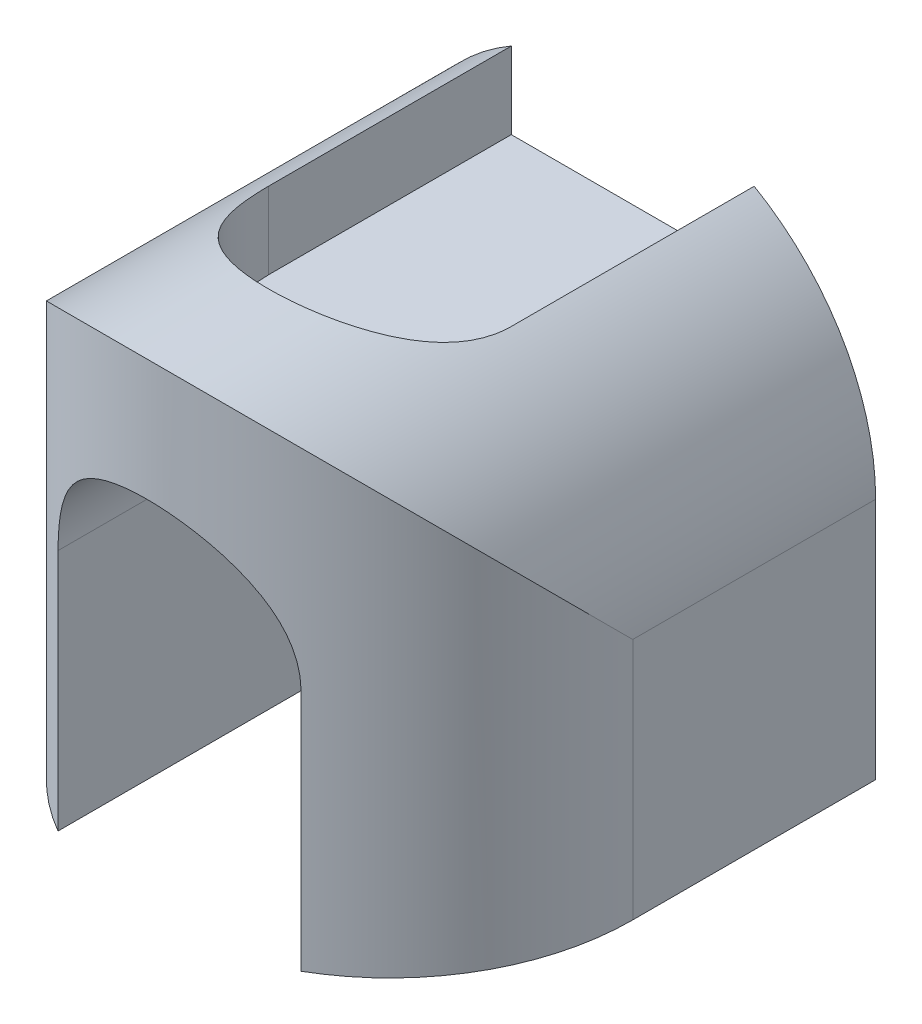
ISO-10303-21;
HEADER;
FILE_DESCRIPTION(('STEP AP214'),'2;1');
FILE_NAME('part.step','',(''),(''),'','','');
FILE_SCHEMA(('AUTOMOTIVE_DESIGN { 1 0 10303 214 1 1 1 1 }'));
ENDSEC;
DATA;
#1=APPLICATION_CONTEXT('core data for automotive mechanical design processes');
#2=APPLICATION_PROTOCOL_DEFINITION('international standard','automotive_design',2000,#1);
#3=PRODUCT_CONTEXT('',#1,'mechanical');
#4=PRODUCT('Part','Part','',(#3));
#5=PRODUCT_RELATED_PRODUCT_CATEGORY('part','',(#4));
#6=PRODUCT_DEFINITION_FORMATION('','',#4);
#7=PRODUCT_DEFINITION_CONTEXT('part definition',#1,'design');
#8=PRODUCT_DEFINITION('design','',#6,#7);
#9=PRODUCT_DEFINITION_SHAPE('','',#8);
#10=(LENGTH_UNIT() NAMED_UNIT(*) SI_UNIT(.MILLI.,.METRE.));
#11=(NAMED_UNIT(*) PLANE_ANGLE_UNIT() SI_UNIT($,.RADIAN.));
#12=(NAMED_UNIT(*) SI_UNIT($,.STERADIAN.) SOLID_ANGLE_UNIT());
#13=UNCERTAINTY_MEASURE_WITH_UNIT(LENGTH_MEASURE(1.E-05),#10,'distance_accuracy_value','');
#14=(GEOMETRIC_REPRESENTATION_CONTEXT(3) GLOBAL_UNCERTAINTY_ASSIGNED_CONTEXT((#13)) GLOBAL_UNIT_ASSIGNED_CONTEXT((#10,
#11,#12)) REPRESENTATION_CONTEXT('',''));
#15=CARTESIAN_POINT('',(0.,0.,0.));
#16=DIRECTION('',(0.,0.,1.));
#17=DIRECTION('',(1.,0.,0.));
#18=AXIS2_PLACEMENT_3D('',#15,#16,#17);
#19=CARTESIAN_POINT('',(0.,0.,40.));
#20=DIRECTION('',(0.,0.,-1.));
#21=DIRECTION('',(-1.,0.,0.));
#22=AXIS2_PLACEMENT_3D('',#19,#20,#21);
#23=CYLINDRICAL_SURFACE('',#22,20.);
#24=DIRECTION('',(0.,0.,-1.));
#25=VECTOR('',#24,1.);
#26=CARTESIAN_POINT('',(10.,17.3205080756888,40.));
#27=LINE('',#26,#25);
#28=CARTESIAN_POINT('',(10.,17.3205080756888,20.));
#29=VERTEX_POINT('',#28);
#30=CARTESIAN_POINT('',(10.,17.3205080756888,0.));
#31=VERTEX_POINT('',#30);
#32=EDGE_CURVE('E187',#29,#31,#27,.T.);
#33=ORIENTED_EDGE('',*,*,#32,.F.);
#34=CARTESIAN_POINT('',(-10.,17.3205080756888,20.));
#35=CARTESIAN_POINT('',(-10.0000009842124,17.3205050641394,20.1309481887177));
#36=CARTESIAN_POINT('',(-9.99742732625388,17.3219937060935,20.2618779028696));
#37=CARTESIAN_POINT('',(-9.98714776425291,17.3279234432275,20.5234618018907));
#38=CARTESIAN_POINT('',(-9.97944213678539,17.3323643793008,20.6541160012275));
#39=CARTESIAN_POINT('',(-9.94866974837697,17.3500596416635,21.0451087265621));
#40=CARTESIAN_POINT('',(-9.91794741881244,17.3676865249699,21.304699018759));
#41=CARTESIAN_POINT('',(-9.8367362974047,17.4138095844315,21.8181959651499));
#42=CARTESIAN_POINT('',(-9.78636180553137,17.4422428845971,22.0721266674505));
#43=CARTESIAN_POINT('',(-9.66646257715094,17.5089748862128,22.5741216620408));
#44=CARTESIAN_POINT('',(-9.59693564097866,17.5472747208052,22.8221852769378));
#45=CARTESIAN_POINT('',(-9.43968016486582,17.6323679545355,23.3102904912019));
#46=CARTESIAN_POINT('',(-9.35199562450873,17.6791407881832,23.5503498833224));
#47=CARTESIAN_POINT('',(-9.15913679566113,17.7798210765099,24.0218345151927));
#48=CARTESIAN_POINT('',(-9.05395571516243,17.8337313001978,24.2532563590376));
#49=CARTESIAN_POINT('',(-8.71317979765282,18.0040295108971,24.9333185760515));
#50=CARTESIAN_POINT('',(-8.45244203102761,18.12893414515,25.3674800224477));
#51=CARTESIAN_POINT('',(-7.8465471073072,18.3997336003357,26.2232343962646));
#52=CARTESIAN_POINT('',(-7.49622958837882,18.5465096451787,26.6408951117711));
#53=CARTESIAN_POINT('',(-6.92338914550209,18.7645590020181,27.2208523597303));
#54=CARTESIAN_POINT('',(-6.72441003875209,18.8369339416624,27.4065165853654));
#55=CARTESIAN_POINT('',(-6.31150716738825,18.9792644744862,27.7613726098943));
#56=CARTESIAN_POINT('',(-6.09758884564933,19.0492209350568,27.9305703548759));
#57=CARTESIAN_POINT('',(-5.64077173064867,19.1896485279328,28.2623674866015));
#58=CARTESIAN_POINT('',(-5.39689141389573,19.2598321641552,28.4237390558379));
#59=CARTESIAN_POINT('',(-4.89455061133216,19.3935793416829,28.7252032159182));
#60=CARTESIAN_POINT('',(-4.63608928609077,19.4571425012458,28.8652945799396));
#61=CARTESIAN_POINT('',(-4.10635677049247,19.5757876618577,29.1227469196676));
#62=CARTESIAN_POINT('',(-3.83509177129902,19.6308737081772,29.2401187440554));
#63=CARTESIAN_POINT('',(-3.28159507983371,19.7309449524341,29.4508621897692));
#64=CARTESIAN_POINT('',(-2.99936455702262,19.7759312240512,29.5442363623738));
#65=CARTESIAN_POINT('',(-2.4466183336022,19.8516058112224,29.7000281801925));
#66=CARTESIAN_POINT('',(-2.17669780598383,19.8830836748641,29.7641756552988));
#67=CARTESIAN_POINT('',(-1.63144213832662,19.9352295762845,29.8699291158889));
#68=CARTESIAN_POINT('',(-1.35610723409276,19.9558980837513,29.9115360808056));
#69=CARTESIAN_POINT('',(-0.80244552160341,19.9858175787377,29.9716389681558));
#70=CARTESIAN_POINT('',(-0.524120257703789,19.995074198548,29.9901462913791));
#71=CARTESIAN_POINT('',(0.0332395851752346,20.0019136401319,30.0038287052784));
#72=CARTESIAN_POINT('',(0.312274119721458,19.9994971760034,29.9990052232103));
#73=CARTESIAN_POINT('',(0.844367806078227,19.9837838331364,29.9675358996108));
#74=CARTESIAN_POINT('',(1.09757294060552,19.9714527723846,29.9428269806232));
#75=CARTESIAN_POINT('',(1.60073183471954,19.9374328464931,29.8743158845939));
#76=CARTESIAN_POINT('',(1.85068582195499,19.9157446402238,29.8305150518807));
#77=CARTESIAN_POINT('',(2.34565858124276,19.8635300347526,29.7242974927775));
#78=CARTESIAN_POINT('',(2.59067728660311,19.8330035162016,29.6618805150018));
#79=CARTESIAN_POINT('',(3.07423528621693,19.7638242045079,29.5190674684304));
#80=CARTESIAN_POINT('',(3.3127743477975,19.7251711199886,29.438670754968));
#81=CARTESIAN_POINT('',(3.78518954169205,19.6400282142617,29.2594286116062));
#82=CARTESIAN_POINT('',(4.01895833848334,19.5934390847712,29.16034744187));
#83=CARTESIAN_POINT('',(4.47722056603938,19.4938343438958,28.945313111224));
#84=CARTESIAN_POINT('',(4.70171067275906,19.4408164557423,28.8293539699885));
#85=CARTESIAN_POINT('',(5.35951315865154,19.2738119392068,28.4574894325119));
#86=CARTESIAN_POINT('',(5.77743531530486,19.1518223778732,28.1774906471425));
#87=CARTESIAN_POINT('',(6.60182721893083,18.8844158487149,27.5309818887684));
#88=CARTESIAN_POINT('',(7.00348722464232,18.7378744077245,27.1587987999693));
#89=CARTESIAN_POINT('',(7.55652262572438,18.5186003057334,26.5554290751957));
#90=CARTESIAN_POINT('',(7.73274718812843,18.445540032032,26.346603713432));
#91=CARTESIAN_POINT('',(8.06789407393767,18.3014290360876,25.9147068075736));
#92=CARTESIAN_POINT('',(8.22681373564499,18.2303786242256,25.6916330802604));
#93=CARTESIAN_POINT('',(8.53597765279316,18.0877840708844,25.2174979573013));
#94=CARTESIAN_POINT('',(8.68500029231331,18.0165039408337,24.9655594242478));
#95=CARTESIAN_POINT('',(8.9609796664279,17.8808412437644,24.4482278759882));
#96=CARTESIAN_POINT('',(9.08794650998955,17.816455522008,24.182841097028));
#97=CARTESIAN_POINT('',(9.3183993533513,17.6970127957932,23.6406128858799));
#98=CARTESIAN_POINT('',(9.4219274372145,17.6419391174123,23.3637930558818));
#99=CARTESIAN_POINT('',(9.60448489001812,17.5432230102063,22.8002668094345));
#100=CARTESIAN_POINT('',(9.68352487417583,17.4995756295313,22.5135647368483));
#101=CARTESIAN_POINT('',(9.79104748365429,17.439541171712,22.0420419221541));
#102=CARTESIAN_POINT('',(9.82736239764818,17.4190767417808,21.8594839234884));
#103=CARTESIAN_POINT('',(9.88980406716622,17.3837011157657,21.4921345822246));
#104=CARTESIAN_POINT('',(9.91593364474517,17.368788381523,21.307343872895));
#105=CARTESIAN_POINT('',(9.95786509659559,17.3447842335656,20.9358956684916));
#106=CARTESIAN_POINT('',(9.97364911968101,17.3357028824093,20.7492355080219));
#107=CARTESIAN_POINT('',(9.99472523916496,17.323553102226,20.3750533905339));
#108=CARTESIAN_POINT('',(10.0000130458752,17.3204871316248,20.1875311125457));
#109=CARTESIAN_POINT('',(10.,17.3205080756888,20.));
#110=B_SPLINE_CURVE_WITH_KNOTS('',3,(#34,#35,#36,#37,#38,#39,#40,#41,#42,#43,#44,#45,#46,#47,
#48,#49,#50,#51,#52,#53,#54,#55,#56,#57,#58,#59,#60,#61,#62,#63,#64,#65,#66,#67,#68,#69,#70,#71,
#72,#73,#74,#75,#76,#77,#78,#79,#80,#81,#82,#83,#84,#85,#86,#87,#88,#89,#90,#91,#92,#93,#94,#95,
#96,#97,#98,#99,#100,#101,#102,#103,#104,#105,#106,#107,#108,#109),.UNSPECIFIED.,.F.,.F.,(4,2,2,
2,2,2,2,2,2,2,2,2,2,2,2,2,2,2,2,2,2,2,2,2,2,2,2,2,2,2,2,2,2,2,2,2,2,4),(0.,0.392774327565581,
0.785527489233087,1.57037135503789,2.35071691709555,3.13115213951758,3.90971788549752,
4.68858657241548,6.24719698095272,7.93328360925696,8.77737560337264,9.62116165389614,
10.5222327315746,11.4233557370877,12.3240473851169,13.2246432376562,14.0611635738311,
14.8976475585062,15.7337185344345,16.5697383645888,17.3329555452442,18.096118993782,
18.8592927482725,19.6224938708954,20.3960608010281,21.1699024973104,22.7166903951133,
24.4095700168372,25.2573755876403,26.1053113772903,27.007965371924,27.9102045497694,
28.8108106867752,29.7110258767719,30.2724648773691,30.833748209103,31.3959974995909,
31.9584765279151),.UNSPECIFIED.);
#111=CARTESIAN_POINT('',(-10.,17.3205080756888,20.));
#112=VERTEX_POINT('',#111);
#113=EDGE_CURVE('E12',#112,#29,#110,.T.);
#114=ORIENTED_EDGE('',*,*,#113,.F.);
#115=DIRECTION('',(0.,0.,-1.));
#116=VECTOR('',#115,1.);
#117=CARTESIAN_POINT('',(-10.,17.3205080756888,40.));
#118=LINE('',#117,#116);
#119=CARTESIAN_POINT('',(-10.,17.3205080756888,0.));
#120=VERTEX_POINT('',#119);
#121=EDGE_CURVE('E169',#120,#112,#118,.F.);
#122=ORIENTED_EDGE('',*,*,#121,.F.);
#123=CARTESIAN_POINT('',(0.,0.,0.));
#124=DIRECTION('',(0.,0.,1.));
#125=DIRECTION('',(1.,0.,0.));
#126=AXIS2_PLACEMENT_3D('',#123,#124,#125);
#127=CIRCLE('',#126,20.);
#128=CARTESIAN_POINT('',(-20.,0.,0.));
#129=VERTEX_POINT('',#128);
#130=EDGE_CURVE('E260',#120,#129,#127,.T.);
#131=ORIENTED_EDGE('',*,*,#130,.T.);
#132=DIRECTION('',(0.,0.,-1.));
#133=VECTOR('',#132,1.);
#134=CARTESIAN_POINT('',(-20.,0.,40.));
#135=LINE('',#134,#133);
#136=CARTESIAN_POINT('',(-20.,0.,20.0000000000002));
#137=VERTEX_POINT('',#136);
#138=EDGE_CURVE('E272',#137,#129,#135,.T.);
#139=ORIENTED_EDGE('',*,*,#138,.F.);
#140=CARTESIAN_POINT('',(0.,0.,20.0000000000001));
#141=DIRECTION('',(0.,0.707106781186547,-0.707106781186547));
#142=DIRECTION('',(0.,-0.707106781186547,-0.707106781186547));
#143=AXIS2_PLACEMENT_3D('',#140,#141,#142);
#144=ELLIPSE('',#143,28.2842712474619,20.);
#145=CARTESIAN_POINT('',(20.,0.,20.));
#146=VERTEX_POINT('',#145);
#147=EDGE_CURVE('E207',#137,#146,#144,.T.);
#148=ORIENTED_EDGE('',*,*,#147,.T.);
#149=DIRECTION('',(0.,0.,-1.));
#150=VECTOR('',#149,1.);
#151=CARTESIAN_POINT('',(20.,0.,40.));
#152=LINE('',#151,#150);
#153=CARTESIAN_POINT('',(20.,0.,0.));
#154=VERTEX_POINT('',#153);
#155=EDGE_CURVE('E258',#146,#154,#152,.T.);
#156=ORIENTED_EDGE('',*,*,#155,.T.);
#157=EDGE_CURVE('E253',#154,#31,#127,.T.);
#158=ORIENTED_EDGE('',*,*,#157,.T.);
#159=EDGE_LOOP('',(#33,#114,#122,#131,#139,#148,#156,#158));
#160=FACE_BOUND('',#159,.T.);
#161=ADVANCED_FACE('F69',(#160),#23,.T.);
#162=CARTESIAN_POINT('',(0.,0.,0.));
#163=DIRECTION('',(0.,0.,1.));
#164=DIRECTION('',(1.,0.,0.));
#165=AXIS2_PLACEMENT_3D('',#162,#163,#164);
#166=PLANE('',#165);
#167=DIRECTION('',(0.,-1.,0.));
#168=VECTOR('',#167,1.);
#169=CARTESIAN_POINT('',(10.,0.,0.));
#170=LINE('',#169,#168);
#171=CARTESIAN_POINT('',(10.,11.,0.));
#172=VERTEX_POINT('',#171);
#173=EDGE_CURVE('E81',#31,#172,#170,.T.);
#174=ORIENTED_EDGE('',*,*,#173,.F.);
#175=ORIENTED_EDGE('',*,*,#157,.F.);
#176=DIRECTION('',(0.,1.,0.));
#177=VECTOR('',#176,1.);
#178=CARTESIAN_POINT('',(20.,-20.,0.));
#179=LINE('',#178,#177);
#180=CARTESIAN_POINT('',(20.,-20.,0.));
#181=VERTEX_POINT('',#180);
#182=EDGE_CURVE('E303',#181,#154,#179,.T.);
#183=ORIENTED_EDGE('',*,*,#182,.F.);
#184=DIRECTION('',(1.,0.,0.));
#185=VECTOR('',#184,1.);
#186=CARTESIAN_POINT('',(10.,-20.,0.));
#187=LINE('',#186,#185);
#188=CARTESIAN_POINT('',(10.,-20.,0.));
#189=VERTEX_POINT('',#188);
#190=EDGE_CURVE('E308',#189,#181,#187,.T.);
#191=ORIENTED_EDGE('',*,*,#190,.F.);
#192=DIRECTION('',(0.,1.,0.));
#193=VECTOR('',#192,1.);
#194=CARTESIAN_POINT('',(10.,-20.,0.));
#195=LINE('',#194,#193);
#196=CARTESIAN_POINT('',(10.,0.,0.));
#197=VERTEX_POINT('',#196);
#198=EDGE_CURVE('E300',#189,#197,#195,.T.);
#199=ORIENTED_EDGE('',*,*,#198,.T.);
#200=CARTESIAN_POINT('',(0.,0.,0.));
#201=DIRECTION('',(0.,0.,1.));
#202=DIRECTION('',(1.,0.,0.));
#203=AXIS2_PLACEMENT_3D('',#200,#201,#202);
#204=CIRCLE('',#203,10.);
#205=CARTESIAN_POINT('',(-10.,0.,0.));
#206=VERTEX_POINT('',#205);
#207=EDGE_CURVE('E259',#197,#206,#204,.T.);
#208=ORIENTED_EDGE('',*,*,#207,.T.);
#209=DIRECTION('',(0.,1.,0.));
#210=VECTOR('',#209,1.);
#211=CARTESIAN_POINT('',(-10.,-20.,0.));
#212=LINE('',#211,#210);
#213=CARTESIAN_POINT('',(-10.,-20.,0.));
#214=VERTEX_POINT('',#213);
#215=EDGE_CURVE('E289',#214,#206,#212,.T.);
#216=ORIENTED_EDGE('',*,*,#215,.F.);
#217=DIRECTION('',(1.,0.,0.));
#218=VECTOR('',#217,1.);
#219=CARTESIAN_POINT('',(-20.,-20.,0.));
#220=LINE('',#219,#218);
#221=CARTESIAN_POINT('',(-20.,-20.,0.));
#222=VERTEX_POINT('',#221);
#223=EDGE_CURVE('E287',#222,#214,#220,.T.);
#224=ORIENTED_EDGE('',*,*,#223,.F.);
#225=DIRECTION('',(0.,1.,0.));
#226=VECTOR('',#225,1.);
#227=CARTESIAN_POINT('',(-20.,-20.,0.));
#228=LINE('',#227,#226);
#229=EDGE_CURVE('E265',#222,#129,#228,.T.);
#230=ORIENTED_EDGE('',*,*,#229,.T.);
#231=ORIENTED_EDGE('',*,*,#130,.F.);
#232=DIRECTION('',(0.,1.,0.));
#233=VECTOR('',#232,1.);
#234=CARTESIAN_POINT('',(-10.,0.,0.));
#235=LINE('',#234,#233);
#236=CARTESIAN_POINT('',(-10.,11.,0.));
#237=VERTEX_POINT('',#236);
#238=EDGE_CURVE('E256',#237,#120,#235,.T.);
#239=ORIENTED_EDGE('',*,*,#238,.F.);
#240=DIRECTION('',(-1.,0.,0.));
#241=VECTOR('',#240,1.);
#242=CARTESIAN_POINT('',(-10.,11.,0.));
#243=LINE('',#242,#241);
#244=EDGE_CURVE('E175',#172,#237,#243,.T.);
#245=ORIENTED_EDGE('',*,*,#244,.F.);
#246=EDGE_LOOP('',(#174,#175,#183,#191,#199,#208,#216,#224,#230,#231,#239,#245));
#247=FACE_BOUND('',#246,.T.);
#248=ADVANCED_FACE('F241',(#247),#166,.F.);
#249=CARTESIAN_POINT('',(0.,0.,40.));
#250=DIRECTION('',(0.,0.,-1.));
#251=DIRECTION('',(-1.,0.,0.));
#252=AXIS2_PLACEMENT_3D('',#249,#250,#251);
#253=CYLINDRICAL_SURFACE('',#252,10.);
#254=DIRECTION('',(0.,0.,-1.));
#255=VECTOR('',#254,1.);
#256=CARTESIAN_POINT('',(10.,0.,40.));
#257=LINE('',#256,#255);
#258=CARTESIAN_POINT('',(10.,0.,37.3205080756889));
#259=VERTEX_POINT('',#258);
#260=EDGE_CURVE('E263',#259,#197,#257,.T.);
#261=ORIENTED_EDGE('',*,*,#260,.F.);
#262=CARTESIAN_POINT('',(-10.,0.,37.3205080756889));
#263=CARTESIAN_POINT('',(-10.000000984215,0.13094872199673,37.3205050641017));
#264=CARTESIAN_POINT('',(-9.99742730529081,0.261878969113936,37.3219937182031));
#265=CARTESIAN_POINT('',(-9.98714766005924,0.523463920508904,37.327923503303));
#266=CARTESIAN_POINT('',(-9.97944197073145,0.654118639275454,37.3323644749622));
#267=CARTESIAN_POINT('',(-9.94866933536781,1.04511291980526,37.3500598787698));
#268=CARTESIAN_POINT('',(-9.91794675933452,1.3047042390063,37.3676869026218));
#269=CARTESIAN_POINT('',(-9.83673531691267,1.81820111984569,37.4138101382344));
#270=CARTESIAN_POINT('',(-9.78636091063379,2.07213076339158,37.4422433859392));
#271=CARTESIAN_POINT('',(-9.66646201269453,2.574123676091,37.5089751971051));
#272=CARTESIAN_POINT('',(-9.59693532178005,2.8221862679775,37.5472748934963));
#273=CARTESIAN_POINT('',(-9.4396793647549,3.31029297438736,37.6323683875193));
#274=CARTESIAN_POINT('',(-9.3519938371968,3.55035477609742,37.6791417416668));
#275=CARTESIAN_POINT('',(-9.15913334247235,4.02184243339158,37.7798228588074));
#276=CARTESIAN_POINT('',(-9.05395170182305,4.25326495232427,37.8337333424839));
#277=CARTESIAN_POINT('',(-8.71317625733138,4.93332447307593,38.0040312066431));
#278=CARTESIAN_POINT('',(-8.45244005024954,5.36748282460836,38.1289350305754));
#279=CARTESIAN_POINT('',(-7.84656420989442,6.22321023597895,38.3997259563388));
#280=CARTESIAN_POINT('',(-7.49626765686819,6.64084970196692,38.5464936937439));
#281=CARTESIAN_POINT('',(-6.92349098431146,7.22075269528582,38.7645209708743));
#282=CARTESIAN_POINT('',(-6.72455446978211,7.40638348660362,38.8368818421353));
#283=CARTESIAN_POINT('',(-6.31163828351169,7.76126888568761,38.9792215859317));
#284=CARTESIAN_POINT('',(-6.09765649108173,7.93052117682031,39.0492001205963));
#285=CARTESIAN_POINT('',(-5.64063714290816,8.26246528955366,39.1896899221144));
#286=CARTESIAN_POINT('',(-5.39661326134269,8.42392326571119,39.2599122810526));
#287=CARTESIAN_POINT('',(-4.89408677426985,8.72546426873085,39.3936967717565));
#288=CARTESIAN_POINT('',(-4.63559019908704,8.8655561089132,39.4572616462606));
#289=CARTESIAN_POINT('',(-4.10588483383744,9.12295729010238,39.5758859888146));
#290=CARTESIAN_POINT('',(-3.83468682404423,9.24028553167694,39.6309525051939));
#291=CARTESIAN_POINT('',(-3.28135623776141,9.45094051611206,39.7309825485809));
#292=CARTESIAN_POINT('',(-2.99922656372144,9.54427358032443,39.7759487360504));
#293=CARTESIAN_POINT('',(-2.49363140780883,9.68677880221809,39.8451704687608));
#294=CARTESIAN_POINT('',(-2.2719482848358,9.74117440346032,39.8718098257335));
#295=CARTESIAN_POINT('',(-1.82466722510283,9.83477362897348,39.9178589511061));
#296=CARTESIAN_POINT('',(-1.59906977643617,9.87397913333698,39.9372696141968));
#297=CARTESIAN_POINT('',(-1.14520441946252,9.93685020664577,39.9684813389906));
#298=CARTESIAN_POINT('',(-0.916936612649072,9.96051636426167,39.9802826889539));
#299=CARTESIAN_POINT('',(-0.459116990597574,9.992089392439,39.9960412601127));
#300=CARTESIAN_POINT('',(-0.229565578561076,10.0000009604476,40.0000008194438));
#301=CARTESIAN_POINT('',(0.263194264553912,9.99999889885797,39.9999990605174));
#302=CARTESIAN_POINT('',(0.526407150091611,9.98959728887724,39.9947924583089));
#303=CARTESIAN_POINT('',(1.05080121426092,9.94811606492436,39.9741006184255));
#304=CARTESIAN_POINT('',(1.31198220167086,9.91703452802356,39.9586144249004));
#305=CARTESIAN_POINT('',(1.83046089190228,9.8345489891991,39.9177576706886));
#306=CARTESIAN_POINT('',(2.08775655612372,9.78313467886946,39.8923820963317));
#307=CARTESIAN_POINT('',(2.59648776024149,9.6605752342226,39.8323942426797));
#308=CARTESIAN_POINT('',(2.84792337916241,9.58943036614535,39.7977820880214));
#309=CARTESIAN_POINT('',(3.34243692637582,9.42844123001871,39.7203079463846));
#310=CARTESIAN_POINT('',(3.58554057926635,9.33866198373279,39.6774746838025));
#311=CARTESIAN_POINT('',(4.06285899516998,9.14111030787892,39.5844914405517));
#312=CARTESIAN_POINT('',(4.29707375177871,9.03333786534732,39.5343414546114));
#313=CARTESIAN_POINT('',(4.75535899172592,8.80071555573175,39.4278640967168));
#314=CARTESIAN_POINT('',(4.97943031477221,8.67586710571114,39.371537237431));
#315=CARTESIAN_POINT('',(5.4164721544221,8.40995192255985,39.253910486402));
#316=CARTESIAN_POINT('',(5.62943824496234,8.26887879370493,39.1926086363531));
#317=CARTESIAN_POINT('',(6.05571689681047,7.9624915838636,39.0625520410529));
#318=CARTESIAN_POINT('',(6.26827930541296,7.7962296782775,38.9935707941732));
#319=CARTESIAN_POINT('',(6.67882707012753,7.44753745788704,38.8531257129577));
#320=CARTESIAN_POINT('',(6.87681159240388,7.26510621953153,38.7816617369567));
#321=CARTESIAN_POINT('',(7.257411509644,6.88493750239141,38.6379018287485));
#322=CARTESIAN_POINT('',(7.44001800630084,6.68719128709366,38.5656054420058));
#323=CARTESIAN_POINT('',(7.78889171967956,6.27738770962221,38.4219642073102));
#324=CARTESIAN_POINT('',(7.95515586550419,6.06532767031209,38.3506195403641));
#325=CARTESIAN_POINT('',(8.28271084970704,5.61080715663939,38.2052536573537));
#326=CARTESIAN_POINT('',(8.44260517176913,5.36726536733117,38.1314569241544));
#327=CARTESIAN_POINT('',(8.74109056040484,4.86604304212197,37.989459467628));
#328=CARTESIAN_POINT('',(8.87969065320453,4.60836856000718,37.9212563790064));
#329=CARTESIAN_POINT('',(9.13438689472102,4.08030280627099,37.7927886186015));
#330=CARTESIAN_POINT('',(9.25048978910894,3.8099153768739,37.7325215689792));
#331=CARTESIAN_POINT('',(9.45894494841037,3.25811488683776,37.622210105903));
#332=CARTESIAN_POINT('',(9.55129984504407,2.9767030518944,37.5721645598427));
#333=CARTESIAN_POINT('',(9.70625431467032,2.42208593764878,37.4870230592736));
#334=CARTESIAN_POINT('',(9.77030261148809,2.14939572993619,37.4512122659996));
#335=CARTESIAN_POINT('',(9.87543152880008,1.59828756657941,37.3919381383268));
#336=CARTESIAN_POINT('',(9.9165131317228,1.31986985646446,37.3684742757755));
#337=CARTESIAN_POINT('',(9.97504741195794,0.759990521691425,37.3349235279724));
#338=CARTESIAN_POINT('',(9.99251990435795,0.478531649743694,37.3248254250063));
#339=CARTESIAN_POINT('',(10.0036080508421,-0.085000452661384,37.3184259647588));
#340=CARTESIAN_POINT('',(9.99722598083585,-0.367073621943793,37.3221232912867));
#341=CARTESIAN_POINT('',(9.96291619281346,-0.895406859819391,37.3418744613741));
#342=CARTESIAN_POINT('',(9.93766467032408,-1.1419042820525,37.3563929608989));
#343=CARTESIAN_POINT('',(9.86908700060546,-1.63164727657299,37.3954787624278));
#344=CARTESIAN_POINT('',(9.82575487936373,-1.8748917466114,37.4200493857027));
#345=CARTESIAN_POINT('',(9.72152517970333,-2.35640147068733,37.4784296971429));
#346=CARTESIAN_POINT('',(9.66063025516967,-2.59466747118342,37.5122379893793));
#347=CARTESIAN_POINT('',(9.52187862268208,-3.06495735433774,37.5880661853245));
#348=CARTESIAN_POINT('',(9.4440151455857,-3.29697870424278,37.6300893654485));
#349=CARTESIAN_POINT('',(9.27007907469894,-3.75870756704026,37.7221762214662));
#350=CARTESIAN_POINT('',(9.17363110315614,-3.98824110600011,37.7724016621034));
#351=CARTESIAN_POINT('',(8.96448542028328,-4.43842662173775,37.8788077000474));
#352=CARTESIAN_POINT('',(8.85178231019315,-4.65907561645612,37.9349902742269));
#353=CARTESIAN_POINT('',(8.61088753679697,-5.0905480594237,38.0518845805499));
#354=CARTESIAN_POINT('',(8.48269269516361,-5.30136947908362,38.1125972411179));
#355=CARTESIAN_POINT('',(8.21155916833807,-5.71234718328846,38.2371201542059));
#356=CARTESIAN_POINT('',(8.06861958430807,-5.91250281651894,38.3009305954404));
#357=CARTESIAN_POINT('',(7.74962824016412,-6.32612486063017,38.438468739976));
#358=CARTESIAN_POINT('',(7.57167675063061,-6.53805290882837,38.5124266495773));
#359=CARTESIAN_POINT('',(7.19893191417513,-6.94634992085289,38.6605355632296));
#360=CARTESIAN_POINT('',(7.00414279015485,-7.14272276240538,38.7346865143668));
#361=CARTESIAN_POINT('',(6.59849896071725,-7.5190689909558,38.881375711837));
#362=CARTESIAN_POINT('',(6.38763421475512,-7.69903197199742,38.9539129131087));
#363=CARTESIAN_POINT('',(5.95092870813166,-8.0413576356135,39.0955268330902));
#364=CARTESIAN_POINT('',(5.72508602910198,-8.20371805661456,39.164603106529));
#365=CARTESIAN_POINT('',(5.2485444124439,-8.51691610947573,39.3007002699175));
#366=CARTESIAN_POINT('',(4.9971751169792,-8.66684598603385,39.3674695627194));
#367=CARTESIAN_POINT('',(4.48087137106113,-8.94470234979305,39.4933929442508));
#368=CARTESIAN_POINT('',(4.21594292637338,-9.07263847110705,39.5525503644029));
#369=CARTESIAN_POINT('',(3.67451970161199,-9.30508172921373,39.6614853852184));
#370=CARTESIAN_POINT('',(3.39804012539998,-9.40961857925655,39.7112748686663));
#371=CARTESIAN_POINT('',(2.83547390438345,-9.59415217292757,39.8000311435087));
#372=CARTESIAN_POINT('',(2.54939095453116,-9.67415823752079,39.8390020451072));
#373=CARTESIAN_POINT('',(1.89115532691991,-9.82681455483678,39.9138297401585));
#374=CARTESIAN_POINT('',(1.51668698866133,-9.89159637925664,39.9459808933799));
#375=CARTESIAN_POINT('',(0.950502847748705,-9.95654539836458,39.9783007527438));
#376=CARTESIAN_POINT('',(0.760918405325277,-9.97282452621327,39.9864229800442));
#377=CARTESIAN_POINT('',(0.380909586310639,-9.99455459145552,39.9972765593278));
#378=CARTESIAN_POINT('',(0.190484937249008,-10.0000017106461,40.000006010395));
#379=CARTESIAN_POINT('',(0.,-10.,40.0000000000001));
#380=B_SPLINE_CURVE_WITH_KNOTS('',3,(#262,#263,#264,#265,#266,#267,#268,#269,#270,#271,#272,
#273,#274,#275,#276,#277,#278,#279,#280,#281,#282,#283,#284,#285,#286,#287,#288,#289,#290,#291,
#292,#293,#294,#295,#296,#297,#298,#299,#300,#301,#302,#303,#304,#305,#306,#307,#308,#309,#310,
#311,#312,#313,#314,#315,#316,#317,#318,#319,#320,#321,#322,#323,#324,#325,#326,#327,#328,#329,
#330,#331,#332,#333,#334,#335,#336,#337,#338,#339,#340,#341,#342,#343,#344,#345,#346,#347,#348,
#349,#350,#351,#352,#353,#354,#355,#356,#357,#358,#359,#360,#361,#362,#363,#364,#365,#366,#367,
#368,#369,#370,#371,#372,#373,#374,#375,#376,#377,#378,#379),.UNSPECIFIED.,.F.,.F.,(4,2,2,2,2,2,
2,2,2,2,2,2,2,2,2,2,2,2,2,2,2,2,2,2,2,2,2,2,2,2,2,2,2,2,2,2,2,2,2,2,2,2,2,2,2,2,2,2,2,2,2,2,2,2,
2,2,2,2,4),(0.,0.392775926371283,0.785530655961937,1.5703776745694,2.35072008605188,
3.13115214152115,3.90972581717669,4.68859714537828,6.24719700517596,7.93319210901722,
8.77711740162825,9.62116188810148,10.5227470982787,11.4239594017343,12.3244201978373,
13.2246435305674,13.9134626159178,14.6021964182263,15.2909041280134,15.9794064593759,
16.768766370746,17.5581996912222,18.3480337564966,19.1378571644355,19.9249695924288,
20.7120825875196,21.4991303031239,22.2864893411208,23.1212228774499,23.9560041223981,
24.7912651310671,25.626682795082,26.5271831925437,27.4273008252904,28.3271481432501,
29.2268956983597,30.0728566087525,30.9187813293606,31.763995624822,32.6091292823688,
33.3528902633817,34.0968971853787,34.8407917406191,35.584983597359,36.3461778867064,
37.1076255734134,37.8692297469444,38.6308803752468,39.4892712111033,40.3474473825616,
41.2061640173367,42.064990849435,42.9644235767666,43.8634613083929,44.7613508495191,
45.658898795455,46.7996694557797,47.3707068154313,47.9419454258756),.UNSPECIFIED.);
#381=CARTESIAN_POINT('',(-10.,0.,37.3205080756889));
#382=VERTEX_POINT('',#381);
#383=EDGE_CURVE('E201',#382,#259,#380,.T.);
#384=ORIENTED_EDGE('',*,*,#383,.F.);
#385=DIRECTION('',(0.,0.,-1.));
#386=VECTOR('',#385,1.);
#387=CARTESIAN_POINT('',(-10.,0.,40.));
#388=LINE('',#387,#386);
#389=EDGE_CURVE('E270',#382,#206,#388,.T.);
#390=ORIENTED_EDGE('',*,*,#389,.T.);
#391=ORIENTED_EDGE('',*,*,#207,.F.);
#392=EDGE_LOOP('',(#261,#384,#390,#391));
#393=FACE_BOUND('',#392,.T.);
#394=ADVANCED_FACE('F209',(#393),#253,.F.);
#395=CARTESIAN_POINT('',(10.,-20.,40.));
#396=DIRECTION('',(1.,0.,0.));
#397=DIRECTION('',(0.,0.,-1.));
#398=AXIS2_PLACEMENT_3D('',#395,#396,#397);
#399=PLANE('',#398);
#400=DIRECTION('',(0.,-1.,0.));
#401=VECTOR('',#400,1.);
#402=CARTESIAN_POINT('',(10.,20.,37.3205080756889));
#403=LINE('',#402,#401);
#404=CARTESIAN_POINT('',(10.,-20.,37.3205080756889));
#405=VERTEX_POINT('',#404);
#406=EDGE_CURVE('E193',#259,#405,#403,.T.);
#407=ORIENTED_EDGE('',*,*,#406,.F.);
#408=ORIENTED_EDGE('',*,*,#260,.T.);
#409=ORIENTED_EDGE('',*,*,#198,.F.);
#410=DIRECTION('',(0.,0.,-1.));
#411=VECTOR('',#410,1.);
#412=CARTESIAN_POINT('',(10.,-20.,40.));
#413=LINE('',#412,#411);
#414=EDGE_CURVE('E309',#405,#189,#413,.T.);
#415=ORIENTED_EDGE('',*,*,#414,.F.);
#416=EDGE_LOOP('',(#407,#408,#409,#415));
#417=FACE_BOUND('',#416,.T.);
#418=ADVANCED_FACE('F223',(#417),#399,.F.);
#419=CARTESIAN_POINT('',(0.,-20.,0.));
#420=DIRECTION('',(0.,-1.,0.));
#421=DIRECTION('',(0.,0.,-1.));
#422=AXIS2_PLACEMENT_3D('',#419,#420,#421);
#423=PLANE('',#422);
#424=DIRECTION('',(0.,0.,1.));
#425=VECTOR('',#424,1.);
#426=CARTESIAN_POINT('',(20.,-20.,40.));
#427=LINE('',#426,#425);
#428=CARTESIAN_POINT('',(20.,-20.,20.));
#429=VERTEX_POINT('',#428);
#430=EDGE_CURVE('E305',#181,#429,#427,.T.);
#431=ORIENTED_EDGE('',*,*,#430,.T.);
#432=CARTESIAN_POINT('',(0.,-20.,20.0000000000001));
#433=DIRECTION('',(0.,1.,0.));
#434=DIRECTION('',(0.,0.,1.));
#435=AXIS2_PLACEMENT_3D('',#432,#433,#434);
#436=CIRCLE('',#435,20.);
#437=EDGE_CURVE('E190',#429,#405,#436,.F.);
#438=ORIENTED_EDGE('',*,*,#437,.T.);
#439=ORIENTED_EDGE('',*,*,#414,.T.);
#440=ORIENTED_EDGE('',*,*,#190,.T.);
#441=EDGE_LOOP('',(#431,#438,#439,#440));
#442=FACE_BOUND('',#441,.T.);
#443=ADVANCED_FACE('F219',(#442),#423,.T.);
#444=CARTESIAN_POINT('',(-20.,-20.,40.));
#445=DIRECTION('',(1.,0.,0.));
#446=DIRECTION('',(0.,0.,-1.));
#447=AXIS2_PLACEMENT_3D('',#444,#445,#446);
#448=PLANE('',#447);
#449=DIRECTION('',(0.,1.,0.));
#450=VECTOR('',#449,1.);
#451=CARTESIAN_POINT('',(-20.,-20.,20.0000000000002));
#452=LINE('',#451,#450);
#453=CARTESIAN_POINT('',(-20.,-20.,20.0000000000001));
#454=VERTEX_POINT('',#453);
#455=EDGE_CURVE('E96',#454,#137,#452,.T.);
#456=ORIENTED_EDGE('',*,*,#455,.T.);
#457=ORIENTED_EDGE('',*,*,#138,.T.);
#458=ORIENTED_EDGE('',*,*,#229,.F.);
#459=DIRECTION('',(0.,0.,-1.));
#460=VECTOR('',#459,1.);
#461=CARTESIAN_POINT('',(-20.,-20.,40.));
#462=LINE('',#461,#460);
#463=EDGE_CURVE('E298',#454,#222,#462,.T.);
#464=ORIENTED_EDGE('',*,*,#463,.F.);
#465=EDGE_LOOP('',(#456,#457,#458,#464));
#466=FACE_BOUND('',#465,.T.);
#467=ADVANCED_FACE('F222',(#466),#448,.F.);
#468=CARTESIAN_POINT('',(-10.,-20.,40.));
#469=DIRECTION('',(-1.,0.,0.));
#470=DIRECTION('',(0.,0.,1.));
#471=AXIS2_PLACEMENT_3D('',#468,#469,#470);
#472=PLANE('',#471);
#473=ORIENTED_EDGE('',*,*,#389,.F.);
#474=DIRECTION('',(0.,1.,0.));
#475=VECTOR('',#474,1.);
#476=CARTESIAN_POINT('',(-10.,-20.,37.3205080756889));
#477=LINE('',#476,#475);
#478=CARTESIAN_POINT('',(-10.,-20.,37.3205080756889));
#479=VERTEX_POINT('',#478);
#480=EDGE_CURVE('E198',#382,#479,#477,.F.);
#481=ORIENTED_EDGE('',*,*,#480,.T.);
#482=DIRECTION('',(0.,0.,1.));
#483=VECTOR('',#482,1.);
#484=CARTESIAN_POINT('',(-10.,-20.,40.));
#485=LINE('',#484,#483);
#486=EDGE_CURVE('E291',#214,#479,#485,.T.);
#487=ORIENTED_EDGE('',*,*,#486,.F.);
#488=ORIENTED_EDGE('',*,*,#215,.T.);
#489=EDGE_LOOP('',(#473,#481,#487,#488));
#490=FACE_BOUND('',#489,.T.);
#491=ADVANCED_FACE('F234',(#490),#472,.F.);
#492=CARTESIAN_POINT('',(0.,-20.,0.));
#493=DIRECTION('',(0.,-1.,0.));
#494=DIRECTION('',(0.,0.,-1.));
#495=AXIS2_PLACEMENT_3D('',#492,#493,#494);
#496=PLANE('',#495);
#497=CARTESIAN_POINT('',(0.,-20.,20.0000000000001));
#498=DIRECTION('',(0.,-1.,0.));
#499=DIRECTION('',(0.,0.,-1.));
#500=AXIS2_PLACEMENT_3D('',#497,#498,#499);
#501=CIRCLE('',#500,20.);
#502=EDGE_CURVE('E276',#454,#479,#501,.F.);
#503=ORIENTED_EDGE('',*,*,#502,.F.);
#504=ORIENTED_EDGE('',*,*,#463,.T.);
#505=ORIENTED_EDGE('',*,*,#223,.T.);
#506=ORIENTED_EDGE('',*,*,#486,.T.);
#507=EDGE_LOOP('',(#503,#504,#505,#506));
#508=FACE_BOUND('',#507,.T.);
#509=ADVANCED_FACE('F227',(#508),#496,.T.);
#510=CARTESIAN_POINT('',(20.,-20.,40.));
#511=DIRECTION('',(-1.,0.,0.));
#512=DIRECTION('',(0.,0.,1.));
#513=AXIS2_PLACEMENT_3D('',#510,#511,#512);
#514=PLANE('',#513);
#515=ORIENTED_EDGE('',*,*,#155,.F.);
#516=DIRECTION('',(0.,-1.,0.));
#517=VECTOR('',#516,1.);
#518=CARTESIAN_POINT('',(20.,20.,20.));
#519=LINE('',#518,#517);
#520=EDGE_CURVE('E189',#146,#429,#519,.T.);
#521=ORIENTED_EDGE('',*,*,#520,.T.);
#522=ORIENTED_EDGE('',*,*,#430,.F.);
#523=ORIENTED_EDGE('',*,*,#182,.T.);
#524=EDGE_LOOP('',(#515,#521,#522,#523));
#525=FACE_BOUND('',#524,.T.);
#526=ADVANCED_FACE('F216',(#525),#514,.F.);
#527=CARTESIAN_POINT('',(0.,-20.,20.0000000000001));
#528=DIRECTION('',(0.,1.,0.));
#529=DIRECTION('',(0.,0.,1.));
#530=AXIS2_PLACEMENT_3D('',#527,#528,#529);
#531=CYLINDRICAL_SURFACE('',#530,20.);
#532=ORIENTED_EDGE('',*,*,#455,.F.);
#533=ORIENTED_EDGE('',*,*,#502,.T.);
#534=ORIENTED_EDGE('',*,*,#480,.F.);
#535=ORIENTED_EDGE('',*,*,#383,.T.);
#536=ORIENTED_EDGE('',*,*,#406,.T.);
#537=ORIENTED_EDGE('',*,*,#437,.F.);
#538=ORIENTED_EDGE('',*,*,#520,.F.);
#539=ORIENTED_EDGE('',*,*,#147,.F.);
#540=EDGE_LOOP('',(#532,#533,#534,#535,#536,#537,#538,#539));
#541=FACE_BOUND('',#540,.T.);
#542=ADVANCED_FACE('F212',(#541),#531,.T.);
#543=CARTESIAN_POINT('',(0.,62.,20.));
#544=DIRECTION('',(0.,-1.,0.));
#545=DIRECTION('',(0.,0.,-1.));
#546=AXIS2_PLACEMENT_3D('',#543,#544,#545);
#547=CYLINDRICAL_SURFACE('',#546,10.);
#548=ORIENTED_EDGE('',*,*,#113,.T.);
#549=DIRECTION('',(0.,-1.,0.));
#550=VECTOR('',#549,1.);
#551=CARTESIAN_POINT('',(10.,62.,20.));
#552=LINE('',#551,#550);
#553=CARTESIAN_POINT('',(10.,11.,20.));
#554=VERTEX_POINT('',#553);
#555=EDGE_CURVE('E162',#29,#554,#552,.T.);
#556=ORIENTED_EDGE('',*,*,#555,.T.);
#557=CARTESIAN_POINT('',(0.,11.,20.));
#558=DIRECTION('',(0.,1.,0.));
#559=DIRECTION('',(0.,0.,-1.));
#560=AXIS2_PLACEMENT_3D('',#557,#558,#559);
#561=CIRCLE('',#560,10.);
#562=CARTESIAN_POINT('',(-10.,11.,20.));
#563=VERTEX_POINT('',#562);
#564=EDGE_CURVE('E165',#563,#554,#561,.T.);
#565=ORIENTED_EDGE('',*,*,#564,.F.);
#566=DIRECTION('',(0.,-1.,0.));
#567=VECTOR('',#566,1.);
#568=CARTESIAN_POINT('',(-10.,62.,20.));
#569=LINE('',#568,#567);
#570=EDGE_CURVE('E170',#112,#563,#569,.T.);
#571=ORIENTED_EDGE('',*,*,#570,.F.);
#572=EDGE_LOOP('',(#548,#556,#565,#571));
#573=FACE_BOUND('',#572,.T.);
#574=ADVANCED_FACE('F163',(#573),#547,.F.);
#575=CARTESIAN_POINT('',(10.,62.,0.));
#576=DIRECTION('',(-1.,0.,0.));
#577=DIRECTION('',(0.,0.,1.));
#578=AXIS2_PLACEMENT_3D('',#575,#576,#577);
#579=PLANE('',#578);
#580=ORIENTED_EDGE('',*,*,#32,.T.);
#581=ORIENTED_EDGE('',*,*,#173,.T.);
#582=DIRECTION('',(0.,0.,-1.));
#583=VECTOR('',#582,1.);
#584=CARTESIAN_POINT('',(10.,11.,0.));
#585=LINE('',#584,#583);
#586=EDGE_CURVE('E88',#554,#172,#585,.T.);
#587=ORIENTED_EDGE('',*,*,#586,.F.);
#588=ORIENTED_EDGE('',*,*,#555,.F.);
#589=EDGE_LOOP('',(#580,#581,#587,#588));
#590=FACE_BOUND('',#589,.T.);
#591=ADVANCED_FACE('F172',(#590),#579,.T.);
#592=CARTESIAN_POINT('',(-10.,62.,20.));
#593=DIRECTION('',(1.,0.,0.));
#594=DIRECTION('',(0.,0.,-1.));
#595=AXIS2_PLACEMENT_3D('',#592,#593,#594);
#596=PLANE('',#595);
#597=ORIENTED_EDGE('',*,*,#121,.T.);
#598=ORIENTED_EDGE('',*,*,#570,.T.);
#599=DIRECTION('',(0.,0.,1.));
#600=VECTOR('',#599,1.);
#601=CARTESIAN_POINT('',(-10.,11.,20.));
#602=LINE('',#601,#600);
#603=EDGE_CURVE('E180',#237,#563,#602,.T.);
#604=ORIENTED_EDGE('',*,*,#603,.F.);
#605=ORIENTED_EDGE('',*,*,#238,.T.);
#606=EDGE_LOOP('',(#597,#598,#604,#605));
#607=FACE_BOUND('',#606,.T.);
#608=ADVANCED_FACE('F280',(#607),#596,.T.);
#609=CARTESIAN_POINT('',(0.,11.,20.));
#610=DIRECTION('',(0.,-1.,0.));
#611=DIRECTION('',(0.,0.,-1.));
#612=AXIS2_PLACEMENT_3D('',#609,#610,#611);
#613=PLANE('',#612);
#614=ORIENTED_EDGE('',*,*,#564,.T.);
#615=ORIENTED_EDGE('',*,*,#586,.T.);
#616=ORIENTED_EDGE('',*,*,#244,.T.);
#617=ORIENTED_EDGE('',*,*,#603,.T.);
#618=EDGE_LOOP('',(#614,#615,#616,#617));
#619=FACE_BOUND('',#618,.T.);
#620=ADVANCED_FACE('F178',(#619),#613,.F.);
#621=CLOSED_SHELL('',(#161,#248,#394,#418,#443,#467,#491,#509,#526,#542,#574,#591,#608,#620));
#622=MANIFOLD_SOLID_BREP('B2',#621);
#623=ADVANCED_BREP_SHAPE_REPRESENTATION('',(#18,#622),#14);
#624=SHAPE_DEFINITION_REPRESENTATION(#9,#623);
ENDSEC;
END-ISO-10303-21;
